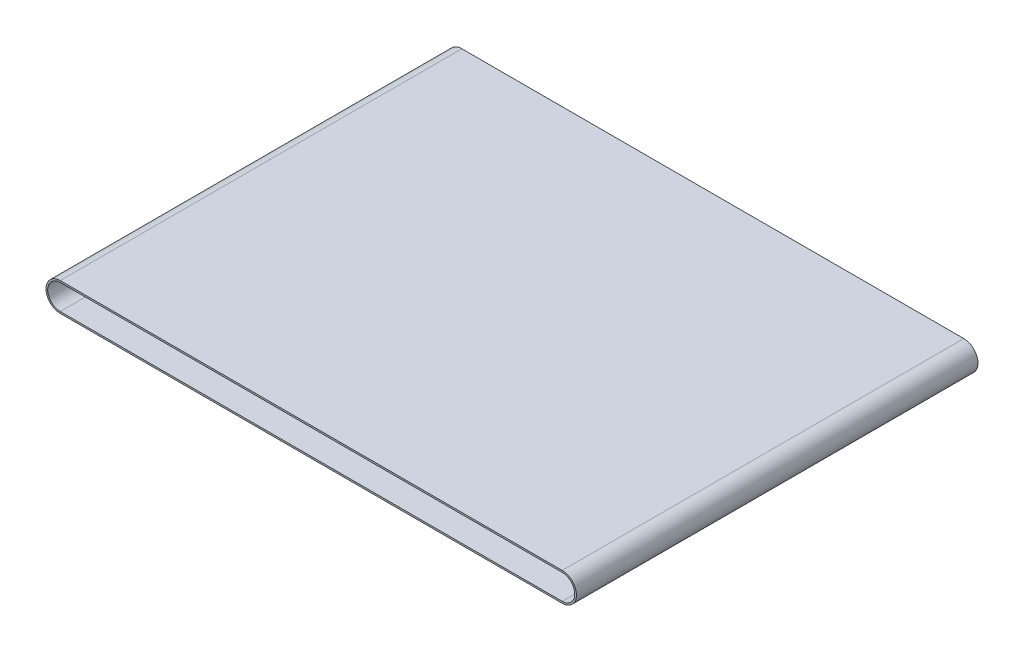
ISO-10303-21;
HEADER;
FILE_DESCRIPTION(('STEP AP214'),'2;1');
FILE_NAME('part.step','',(''),(''),'','','');
FILE_SCHEMA(('AUTOMOTIVE_DESIGN { 1 0 10303 214 1 1 1 1 }'));
ENDSEC;
DATA;
#1=APPLICATION_CONTEXT('core data for automotive mechanical design processes');
#2=APPLICATION_PROTOCOL_DEFINITION('international standard','automotive_design',2000,#1);
#3=PRODUCT_CONTEXT('',#1,'mechanical');
#4=PRODUCT('Part','Part','',(#3));
#5=PRODUCT_RELATED_PRODUCT_CATEGORY('part','',(#4));
#6=PRODUCT_DEFINITION_FORMATION('','',#4);
#7=PRODUCT_DEFINITION_CONTEXT('part definition',#1,'design');
#8=PRODUCT_DEFINITION('design','',#6,#7);
#9=PRODUCT_DEFINITION_SHAPE('','',#8);
#10=(LENGTH_UNIT() NAMED_UNIT(*) SI_UNIT(.MILLI.,.METRE.));
#11=(NAMED_UNIT(*) PLANE_ANGLE_UNIT() SI_UNIT($,.RADIAN.));
#12=(NAMED_UNIT(*) SI_UNIT($,.STERADIAN.) SOLID_ANGLE_UNIT());
#13=UNCERTAINTY_MEASURE_WITH_UNIT(LENGTH_MEASURE(1.E-05),#10,'distance_accuracy_value','');
#14=(GEOMETRIC_REPRESENTATION_CONTEXT(3) GLOBAL_UNCERTAINTY_ASSIGNED_CONTEXT((#13)) GLOBAL_UNIT_ASSIGNED_CONTEXT((#10,
#11,#12)) REPRESENTATION_CONTEXT('',''));
#15=CARTESIAN_POINT('',(0.,0.,0.));
#16=DIRECTION('',(0.,0.,1.));
#17=DIRECTION('',(1.,0.,0.));
#18=AXIS2_PLACEMENT_3D('',#15,#16,#17);
#19=CARTESIAN_POINT('',(-60.6868305236834,18.2881984715618,240.));
#20=DIRECTION('',(0.,0.,1.));
#21=DIRECTION('',(1.,0.,0.));
#22=AXIS2_PLACEMENT_3D('',#19,#20,#21);
#23=PLANE('',#22);
#24=CARTESIAN_POINT('',(-60.6868305236834,18.2881984715618,240.));
#25=DIRECTION('',(0.,0.,1.));
#26=DIRECTION('',(1.,0.,0.));
#27=AXIS2_PLACEMENT_3D('',#24,#25,#26);
#28=CIRCLE('',#27,8.5);
#29=CARTESIAN_POINT('',(-60.6868305236834,26.7881984715618,240.));
#30=VERTEX_POINT('',#29);
#31=CARTESIAN_POINT('',(-60.6868305236834,9.78819847156183,240.));
#32=VERTEX_POINT('',#31);
#33=EDGE_CURVE('E134',#30,#32,#28,.T.);
#34=ORIENTED_EDGE('',*,*,#33,.T.);
#35=DIRECTION('',(1.,0.,0.));
#36=VECTOR('',#35,1.);
#37=CARTESIAN_POINT('',(-60.6868305236834,9.78819847156183,240.));
#38=LINE('',#37,#36);
#39=CARTESIAN_POINT('',(239.313169476317,9.78819847156183,240.));
#40=VERTEX_POINT('',#39);
#41=EDGE_CURVE('E137',#32,#40,#38,.T.);
#42=ORIENTED_EDGE('',*,*,#41,.T.);
#43=CARTESIAN_POINT('',(239.313169476317,18.2881984715618,240.));
#44=DIRECTION('',(0.,0.,1.));
#45=DIRECTION('',(-1.,0.,0.));
#46=AXIS2_PLACEMENT_3D('',#43,#44,#45);
#47=CIRCLE('',#46,8.5);
#48=CARTESIAN_POINT('',(239.313169476317,26.7881984715618,240.));
#49=VERTEX_POINT('',#48);
#50=EDGE_CURVE('E140',#40,#49,#47,.T.);
#51=ORIENTED_EDGE('',*,*,#50,.T.);
#52=DIRECTION('',(-1.,0.,0.));
#53=VECTOR('',#52,1.);
#54=CARTESIAN_POINT('',(-60.6868305236834,26.7881984715618,240.));
#55=LINE('',#54,#53);
#56=EDGE_CURVE('E142',#49,#30,#55,.T.);
#57=ORIENTED_EDGE('',*,*,#56,.T.);
#58=EDGE_LOOP('',(#34,#42,#51,#57));
#59=FACE_BOUND('',#58,.T.);
#60=DIRECTION('',(-1.,0.,0.));
#61=VECTOR('',#60,1.);
#62=CARTESIAN_POINT('',(-60.6868305236834,25.7881984715618,240.));
#63=LINE('',#62,#61);
#64=CARTESIAN_POINT('',(239.313169476317,25.7881984715618,240.));
#65=VERTEX_POINT('',#64);
#66=CARTESIAN_POINT('',(-60.6868305236834,25.7881984715618,240.));
#67=VERTEX_POINT('',#66);
#68=EDGE_CURVE('E106',#65,#67,#63,.T.);
#69=ORIENTED_EDGE('',*,*,#68,.F.);
#70=CARTESIAN_POINT('',(239.313169476317,18.2881984715618,240.));
#71=DIRECTION('',(0.,0.,1.));
#72=DIRECTION('',(-1.,0.,0.));
#73=AXIS2_PLACEMENT_3D('',#70,#71,#72);
#74=CIRCLE('',#73,7.5);
#75=CARTESIAN_POINT('',(239.313169476317,10.7881984715618,240.));
#76=VERTEX_POINT('',#75);
#77=EDGE_CURVE('E98',#76,#65,#74,.T.);
#78=ORIENTED_EDGE('',*,*,#77,.F.);
#79=DIRECTION('',(1.,0.,0.));
#80=VECTOR('',#79,1.);
#81=CARTESIAN_POINT('',(-60.6868305236834,10.7881984715618,240.));
#82=LINE('',#81,#80);
#83=CARTESIAN_POINT('',(-60.6868305236834,10.7881984715618,240.));
#84=VERTEX_POINT('',#83);
#85=EDGE_CURVE('E120',#84,#76,#82,.T.);
#86=ORIENTED_EDGE('',*,*,#85,.F.);
#87=CARTESIAN_POINT('',(-60.6868305236834,18.2881984715618,240.));
#88=DIRECTION('',(0.,0.,1.));
#89=DIRECTION('',(1.,0.,0.));
#90=AXIS2_PLACEMENT_3D('',#87,#88,#89);
#91=CIRCLE('',#90,7.5);
#92=EDGE_CURVE('E118',#67,#84,#91,.T.);
#93=ORIENTED_EDGE('',*,*,#92,.F.);
#94=EDGE_LOOP('',(#69,#78,#86,#93));
#95=FACE_BOUND('',#94,.T.);
#96=ADVANCED_FACE('F33',(#59,#95),#23,.T.);
#97=CARTESIAN_POINT('',(-60.6868305236834,18.2881984715618,0.));
#98=DIRECTION('',(0.,0.,1.));
#99=DIRECTION('',(1.,0.,0.));
#100=AXIS2_PLACEMENT_3D('',#97,#98,#99);
#101=PLANE('',#100);
#102=CARTESIAN_POINT('',(-60.6868305236834,18.2881984715618,0.));
#103=DIRECTION('',(0.,0.,1.));
#104=DIRECTION('',(1.,0.,0.));
#105=AXIS2_PLACEMENT_3D('',#102,#103,#104);
#106=CIRCLE('',#105,8.5);
#107=CARTESIAN_POINT('',(-60.6868305236834,26.7881984715618,0.));
#108=VERTEX_POINT('',#107);
#109=CARTESIAN_POINT('',(-60.6868305236834,9.78819847156183,0.));
#110=VERTEX_POINT('',#109);
#111=EDGE_CURVE('E114',#108,#110,#106,.T.);
#112=ORIENTED_EDGE('',*,*,#111,.F.);
#113=DIRECTION('',(-1.,0.,0.));
#114=VECTOR('',#113,1.);
#115=CARTESIAN_POINT('',(-60.6868305236834,26.7881984715618,0.));
#116=LINE('',#115,#114);
#117=CARTESIAN_POINT('',(239.313169476317,26.7881984715618,0.));
#118=VERTEX_POINT('',#117);
#119=EDGE_CURVE('E138',#118,#108,#116,.T.);
#120=ORIENTED_EDGE('',*,*,#119,.F.);
#121=CARTESIAN_POINT('',(239.313169476317,18.2881984715618,0.));
#122=DIRECTION('',(0.,0.,1.));
#123=DIRECTION('',(-1.,0.,0.));
#124=AXIS2_PLACEMENT_3D('',#121,#122,#123);
#125=CIRCLE('',#124,8.5);
#126=CARTESIAN_POINT('',(239.313169476317,9.78819847156183,0.));
#127=VERTEX_POINT('',#126);
#128=EDGE_CURVE('E149',#127,#118,#125,.T.);
#129=ORIENTED_EDGE('',*,*,#128,.F.);
#130=DIRECTION('',(1.,0.,0.));
#131=VECTOR('',#130,1.);
#132=CARTESIAN_POINT('',(-60.6868305236834,9.78819847156183,0.));
#133=LINE('',#132,#131);
#134=EDGE_CURVE('E147',#110,#127,#133,.T.);
#135=ORIENTED_EDGE('',*,*,#134,.F.);
#136=EDGE_LOOP('',(#112,#120,#129,#135));
#137=FACE_BOUND('',#136,.T.);
#138=CARTESIAN_POINT('',(239.313169476317,18.2881984715618,0.));
#139=DIRECTION('',(0.,0.,1.));
#140=DIRECTION('',(-1.,0.,0.));
#141=AXIS2_PLACEMENT_3D('',#138,#139,#140);
#142=CIRCLE('',#141,7.5);
#143=CARTESIAN_POINT('',(239.313169476317,10.7881984715618,0.));
#144=VERTEX_POINT('',#143);
#145=CARTESIAN_POINT('',(239.313169476317,25.7881984715618,0.));
#146=VERTEX_POINT('',#145);
#147=EDGE_CURVE('E56',#144,#146,#142,.T.);
#148=ORIENTED_EDGE('',*,*,#147,.T.);
#149=DIRECTION('',(-1.,0.,0.));
#150=VECTOR('',#149,1.);
#151=CARTESIAN_POINT('',(-60.6868305236834,25.7881984715618,0.));
#152=LINE('',#151,#150);
#153=CARTESIAN_POINT('',(-60.6868305236834,25.7881984715618,0.));
#154=VERTEX_POINT('',#153);
#155=EDGE_CURVE('E113',#146,#154,#152,.T.);
#156=ORIENTED_EDGE('',*,*,#155,.T.);
#157=CARTESIAN_POINT('',(-60.6868305236834,18.2881984715618,0.));
#158=DIRECTION('',(0.,0.,1.));
#159=DIRECTION('',(1.,0.,0.));
#160=AXIS2_PLACEMENT_3D('',#157,#158,#159);
#161=CIRCLE('',#160,7.5);
#162=CARTESIAN_POINT('',(-60.6868305236834,10.7881984715618,0.));
#163=VERTEX_POINT('',#162);
#164=EDGE_CURVE('E126',#154,#163,#161,.T.);
#165=ORIENTED_EDGE('',*,*,#164,.T.);
#166=DIRECTION('',(1.,0.,0.));
#167=VECTOR('',#166,1.);
#168=CARTESIAN_POINT('',(-60.6868305236834,10.7881984715618,0.));
#169=LINE('',#168,#167);
#170=EDGE_CURVE('E107',#163,#144,#169,.T.);
#171=ORIENTED_EDGE('',*,*,#170,.T.);
#172=EDGE_LOOP('',(#148,#156,#165,#171));
#173=FACE_BOUND('',#172,.T.);
#174=ADVANCED_FACE('F167',(#137,#173),#101,.F.);
#175=CARTESIAN_POINT('',(-60.6868305236834,18.2881984715618,240.));
#176=DIRECTION('',(0.,0.,-1.));
#177=DIRECTION('',(-1.,0.,0.));
#178=AXIS2_PLACEMENT_3D('',#175,#176,#177);
#179=CYLINDRICAL_SURFACE('',#178,8.5);
#180=ORIENTED_EDGE('',*,*,#111,.T.);
#181=DIRECTION('',(0.,0.,-1.));
#182=VECTOR('',#181,1.);
#183=CARTESIAN_POINT('',(-60.6868305236834,9.78819847156183,240.));
#184=LINE('',#183,#182);
#185=EDGE_CURVE('E11',#32,#110,#184,.T.);
#186=ORIENTED_EDGE('',*,*,#185,.F.);
#187=ORIENTED_EDGE('',*,*,#33,.F.);
#188=DIRECTION('',(0.,0.,-1.));
#189=VECTOR('',#188,1.);
#190=CARTESIAN_POINT('',(-60.6868305236834,26.7881984715618,240.));
#191=LINE('',#190,#189);
#192=EDGE_CURVE('E144',#30,#108,#191,.T.);
#193=ORIENTED_EDGE('',*,*,#192,.T.);
#194=EDGE_LOOP('',(#180,#186,#187,#193));
#195=FACE_BOUND('',#194,.T.);
#196=ADVANCED_FACE('F35',(#195),#179,.T.);
#197=CARTESIAN_POINT('',(-60.6868305236834,9.78819847156183,240.));
#198=DIRECTION('',(0.,1.,0.));
#199=DIRECTION('',(0.,0.,1.));
#200=AXIS2_PLACEMENT_3D('',#197,#198,#199);
#201=PLANE('',#200);
#202=ORIENTED_EDGE('',*,*,#134,.T.);
#203=DIRECTION('',(0.,0.,-1.));
#204=VECTOR('',#203,1.);
#205=CARTESIAN_POINT('',(239.313169476317,9.78819847156183,240.));
#206=LINE('',#205,#204);
#207=EDGE_CURVE('E41',#40,#127,#206,.T.);
#208=ORIENTED_EDGE('',*,*,#207,.F.);
#209=ORIENTED_EDGE('',*,*,#41,.F.);
#210=ORIENTED_EDGE('',*,*,#185,.T.);
#211=EDGE_LOOP('',(#202,#208,#209,#210));
#212=FACE_BOUND('',#211,.T.);
#213=ADVANCED_FACE('F177',(#212),#201,.F.);
#214=CARTESIAN_POINT('',(239.313169476317,18.2881984715618,240.));
#215=DIRECTION('',(0.,0.,-1.));
#216=DIRECTION('',(-1.,0.,0.));
#217=AXIS2_PLACEMENT_3D('',#214,#215,#216);
#218=CYLINDRICAL_SURFACE('',#217,8.5);
#219=ORIENTED_EDGE('',*,*,#128,.T.);
#220=DIRECTION('',(0.,0.,-1.));
#221=VECTOR('',#220,1.);
#222=CARTESIAN_POINT('',(239.313169476317,26.7881984715618,240.));
#223=LINE('',#222,#221);
#224=EDGE_CURVE('E154',#49,#118,#223,.T.);
#225=ORIENTED_EDGE('',*,*,#224,.F.);
#226=ORIENTED_EDGE('',*,*,#50,.F.);
#227=ORIENTED_EDGE('',*,*,#207,.T.);
#228=EDGE_LOOP('',(#219,#225,#226,#227));
#229=FACE_BOUND('',#228,.T.);
#230=ADVANCED_FACE('F161',(#229),#218,.T.);
#231=CARTESIAN_POINT('',(-60.6868305236834,26.7881984715618,240.));
#232=DIRECTION('',(0.,-1.,0.));
#233=DIRECTION('',(0.,0.,-1.));
#234=AXIS2_PLACEMENT_3D('',#231,#232,#233);
#235=PLANE('',#234);
#236=ORIENTED_EDGE('',*,*,#119,.T.);
#237=ORIENTED_EDGE('',*,*,#192,.F.);
#238=ORIENTED_EDGE('',*,*,#56,.F.);
#239=ORIENTED_EDGE('',*,*,#224,.T.);
#240=EDGE_LOOP('',(#236,#237,#238,#239));
#241=FACE_BOUND('',#240,.T.);
#242=ADVANCED_FACE('F171',(#241),#235,.F.);
#243=CARTESIAN_POINT('',(239.313169476317,18.2881984715618,240.));
#244=DIRECTION('',(0.,0.,-1.));
#245=DIRECTION('',(-1.,0.,0.));
#246=AXIS2_PLACEMENT_3D('',#243,#244,#245);
#247=CYLINDRICAL_SURFACE('',#246,7.5);
#248=ORIENTED_EDGE('',*,*,#147,.F.);
#249=DIRECTION('',(0.,0.,-1.));
#250=VECTOR('',#249,1.);
#251=CARTESIAN_POINT('',(239.313169476317,10.7881984715618,240.));
#252=LINE('',#251,#250);
#253=EDGE_CURVE('E102',#76,#144,#252,.T.);
#254=ORIENTED_EDGE('',*,*,#253,.F.);
#255=ORIENTED_EDGE('',*,*,#77,.T.);
#256=DIRECTION('',(0.,0.,-1.));
#257=VECTOR('',#256,1.);
#258=CARTESIAN_POINT('',(239.313169476317,25.7881984715618,240.));
#259=LINE('',#258,#257);
#260=EDGE_CURVE('E101',#65,#146,#259,.T.);
#261=ORIENTED_EDGE('',*,*,#260,.T.);
#262=EDGE_LOOP('',(#248,#254,#255,#261));
#263=FACE_BOUND('',#262,.T.);
#264=ADVANCED_FACE('F100',(#263),#247,.F.);
#265=CARTESIAN_POINT('',(-60.6868305236834,25.7881984715618,240.));
#266=DIRECTION('',(0.,-1.,0.));
#267=DIRECTION('',(0.,0.,-1.));
#268=AXIS2_PLACEMENT_3D('',#265,#266,#267);
#269=PLANE('',#268);
#270=ORIENTED_EDGE('',*,*,#155,.F.);
#271=ORIENTED_EDGE('',*,*,#260,.F.);
#272=ORIENTED_EDGE('',*,*,#68,.T.);
#273=DIRECTION('',(0.,0.,-1.));
#274=VECTOR('',#273,1.);
#275=CARTESIAN_POINT('',(-60.6868305236834,25.7881984715618,240.));
#276=LINE('',#275,#274);
#277=EDGE_CURVE('E115',#67,#154,#276,.T.);
#278=ORIENTED_EDGE('',*,*,#277,.T.);
#279=EDGE_LOOP('',(#270,#271,#272,#278));
#280=FACE_BOUND('',#279,.T.);
#281=ADVANCED_FACE('F110',(#280),#269,.T.);
#282=CARTESIAN_POINT('',(-60.6868305236834,18.2881984715618,240.));
#283=DIRECTION('',(0.,0.,-1.));
#284=DIRECTION('',(-1.,0.,0.));
#285=AXIS2_PLACEMENT_3D('',#282,#283,#284);
#286=CYLINDRICAL_SURFACE('',#285,7.5);
#287=ORIENTED_EDGE('',*,*,#164,.F.);
#288=ORIENTED_EDGE('',*,*,#277,.F.);
#289=ORIENTED_EDGE('',*,*,#92,.T.);
#290=DIRECTION('',(0.,0.,-1.));
#291=VECTOR('',#290,1.);
#292=CARTESIAN_POINT('',(-60.6868305236834,10.7881984715618,240.));
#293=LINE('',#292,#291);
#294=EDGE_CURVE('E48',#84,#163,#293,.T.);
#295=ORIENTED_EDGE('',*,*,#294,.T.);
#296=EDGE_LOOP('',(#287,#288,#289,#295));
#297=FACE_BOUND('',#296,.T.);
#298=ADVANCED_FACE('F200',(#297),#286,.F.);
#299=CARTESIAN_POINT('',(-60.6868305236834,10.7881984715618,240.));
#300=DIRECTION('',(0.,1.,0.));
#301=DIRECTION('',(0.,0.,1.));
#302=AXIS2_PLACEMENT_3D('',#299,#300,#301);
#303=PLANE('',#302);
#304=ORIENTED_EDGE('',*,*,#170,.F.);
#305=ORIENTED_EDGE('',*,*,#294,.F.);
#306=ORIENTED_EDGE('',*,*,#85,.T.);
#307=ORIENTED_EDGE('',*,*,#253,.T.);
#308=EDGE_LOOP('',(#304,#305,#306,#307));
#309=FACE_BOUND('',#308,.T.);
#310=ADVANCED_FACE('F204',(#309),#303,.T.);
#311=CLOSED_SHELL('',(#96,#174,#196,#213,#230,#242,#264,#281,#298,#310));
#312=MANIFOLD_SOLID_BREP('B2',#311);
#313=ADVANCED_BREP_SHAPE_REPRESENTATION('',(#18,#312),#14);
#314=SHAPE_DEFINITION_REPRESENTATION(#9,#313);
ENDSEC;
END-ISO-10303-21;
